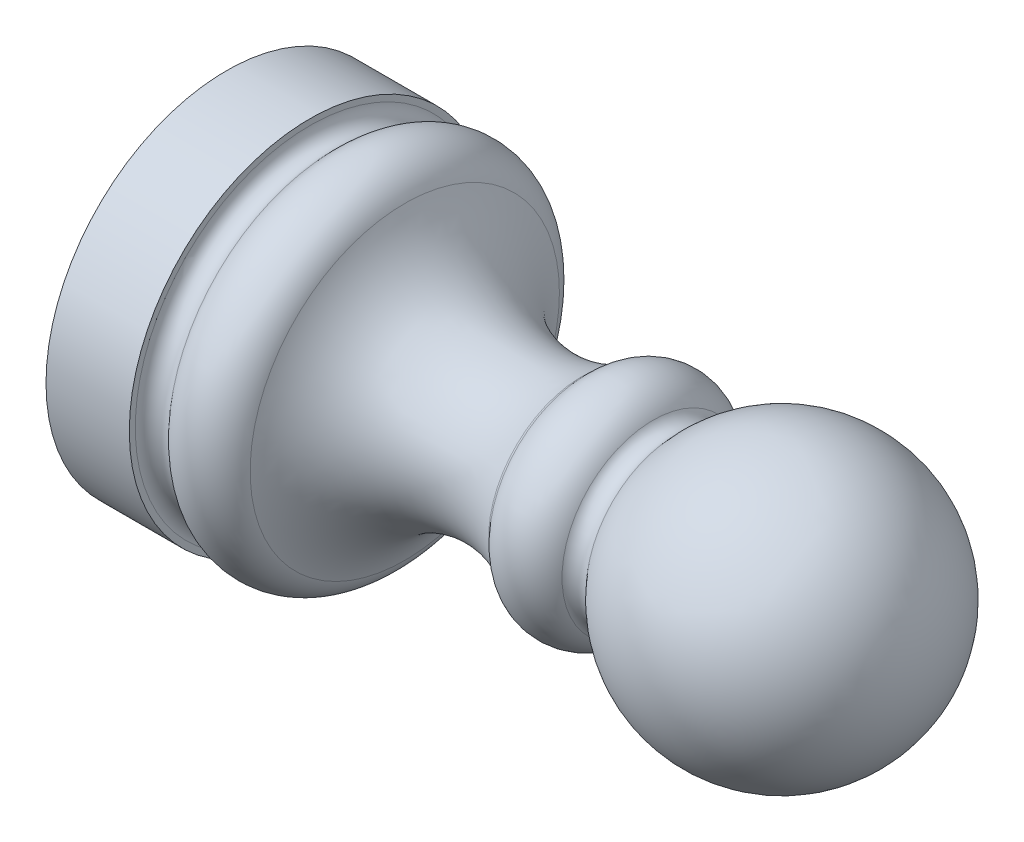
ISO-10303-21;
HEADER;
FILE_DESCRIPTION(('STEP AP214'),'2;1');
FILE_NAME('part.step','',(''),(''),'','','');
FILE_SCHEMA(('AUTOMOTIVE_DESIGN { 1 0 10303 214 1 1 1 1 }'));
ENDSEC;
DATA;
#1=APPLICATION_CONTEXT('core data for automotive mechanical design processes');
#2=APPLICATION_PROTOCOL_DEFINITION('international standard','automotive_design',2000,#1);
#3=PRODUCT_CONTEXT('',#1,'mechanical');
#4=PRODUCT('Part','Part','',(#3));
#5=PRODUCT_RELATED_PRODUCT_CATEGORY('part','',(#4));
#6=PRODUCT_DEFINITION_FORMATION('','',#4);
#7=PRODUCT_DEFINITION_CONTEXT('part definition',#1,'design');
#8=PRODUCT_DEFINITION('design','',#6,#7);
#9=PRODUCT_DEFINITION_SHAPE('','',#8);
#10=(LENGTH_UNIT() NAMED_UNIT(*) SI_UNIT(.MILLI.,.METRE.));
#11=(NAMED_UNIT(*) PLANE_ANGLE_UNIT() SI_UNIT($,.RADIAN.));
#12=(NAMED_UNIT(*) SI_UNIT($,.STERADIAN.) SOLID_ANGLE_UNIT());
#13=UNCERTAINTY_MEASURE_WITH_UNIT(LENGTH_MEASURE(1.E-05),#10,'distance_accuracy_value','');
#14=(GEOMETRIC_REPRESENTATION_CONTEXT(3) GLOBAL_UNCERTAINTY_ASSIGNED_CONTEXT((#13)) GLOBAL_UNIT_ASSIGNED_CONTEXT((#10,
#11,#12)) REPRESENTATION_CONTEXT('',''));
#15=CARTESIAN_POINT('',(0.,0.,0.));
#16=DIRECTION('',(0.,0.,1.));
#17=DIRECTION('',(1.,0.,0.));
#18=AXIS2_PLACEMENT_3D('',#15,#16,#17);
#19=CARTESIAN_POINT('',(0.,0.,0.));
#20=DIRECTION('',(1.,0.,0.));
#21=DIRECTION('',(0.,0.,-1.));
#22=AXIS2_PLACEMENT_3D('',#19,#20,#21);
#23=PLANE('',#22);
#24=CARTESIAN_POINT('',(0.,0.,0.));
#25=DIRECTION('',(1.,0.,0.));
#26=DIRECTION('',(0.,0.,-1.));
#27=AXIS2_PLACEMENT_3D('',#24,#25,#26);
#28=CIRCLE('',#27,6.5);
#29=CARTESIAN_POINT('',(0.,0.,-6.5));
#30=VERTEX_POINT('',#29);
#31=EDGE_CURVE('E10',#30,#30,#28,.T.);
#32=ORIENTED_EDGE('',*,*,#31,.F.);
#33=EDGE_LOOP('',(#32));
#34=FACE_BOUND('',#33,.T.);
#35=ADVANCED_FACE('F38',(#34),#23,.F.);
#36=CARTESIAN_POINT('',(0.,0.,0.));
#37=DIRECTION('',(1.,0.,0.));
#38=DIRECTION('',(0.,0.,-1.));
#39=AXIS2_PLACEMENT_3D('',#36,#37,#38);
#40=CYLINDRICAL_SURFACE('',#39,6.5);
#41=CARTESIAN_POINT('',(3.,0.,0.));
#42=DIRECTION('',(1.,0.,0.));
#43=DIRECTION('',(0.,0.,-1.));
#44=AXIS2_PLACEMENT_3D('',#41,#42,#43);
#45=CIRCLE('',#44,6.5);
#46=CARTESIAN_POINT('',(3.,0.,-6.5));
#47=VERTEX_POINT('',#46);
#48=EDGE_CURVE('E45',#47,#47,#45,.T.);
#49=ORIENTED_EDGE('',*,*,#48,.F.);
#50=EDGE_LOOP('',(#49));
#51=FACE_BOUND('',#50,.T.);
#52=ORIENTED_EDGE('',*,*,#31,.T.);
#53=EDGE_LOOP('',(#52));
#54=FACE_BOUND('',#53,.T.);
#55=ADVANCED_FACE('F125',(#51,#54),#40,.T.);
#56=CARTESIAN_POINT('',(3.,-6.5,0.));
#57=DIRECTION('',(-1.,0.,0.));
#58=DIRECTION('',(0.,0.,1.));
#59=AXIS2_PLACEMENT_3D('',#56,#57,#58);
#60=PLANE('',#59);
#61=CARTESIAN_POINT('',(3.,0.,0.));
#62=DIRECTION('',(1.,0.,0.));
#63=DIRECTION('',(0.,0.,-1.));
#64=AXIS2_PLACEMENT_3D('',#61,#62,#63);
#65=CIRCLE('',#64,6.28557521937307);
#66=CARTESIAN_POINT('',(3.,0.,-6.28557521937307));
#67=VERTEX_POINT('',#66);
#68=EDGE_CURVE('E51',#67,#67,#65,.T.);
#69=ORIENTED_EDGE('',*,*,#68,.F.);
#70=EDGE_LOOP('',(#69));
#71=FACE_BOUND('',#70,.T.);
#72=ORIENTED_EDGE('',*,*,#48,.T.);
#73=EDGE_LOOP('',(#72));
#74=FACE_BOUND('',#73,.T.);
#75=ADVANCED_FACE('F120',(#71,#74),#60,.F.);
#76=CARTESIAN_POINT('',(3.5,0.,0.));
#77=DIRECTION('',(1.,0.,0.));
#78=DIRECTION('',(0.,0.,-1.));
#79=AXIS2_PLACEMENT_3D('',#76,#77,#78);
#80=TOROIDAL_SURFACE('',#79,6.28557521937307,0.5);
#81=CARTESIAN_POINT('',(3.88302222155949,0.,0.));
#82=DIRECTION('',(1.,0.,0.));
#83=DIRECTION('',(0.,0.,-1.));
#84=AXIS2_PLACEMENT_3D('',#81,#82,#83);
#85=CIRCLE('',#84,5.9641814145298);
#86=CARTESIAN_POINT('',(3.88302222155949,0.,-5.9641814145298));
#87=VERTEX_POINT('',#86);
#88=EDGE_CURVE('E57',#87,#87,#85,.T.);
#89=ORIENTED_EDGE('',*,*,#88,.F.);
#90=EDGE_LOOP('',(#89));
#91=FACE_BOUND('',#90,.T.);
#92=ORIENTED_EDGE('',*,*,#68,.T.);
#93=EDGE_LOOP('',(#92));
#94=FACE_BOUND('',#93,.T.);
#95=ADVANCED_FACE('F114',(#91,#94),#80,.F.);
#96=CARTESIAN_POINT('',(5.03208888623796,0.,0.));
#97=DIRECTION('',(1.,0.,0.));
#98=DIRECTION('',(0.,0.,-1.));
#99=AXIS2_PLACEMENT_3D('',#96,#97,#98);
#100=TOROIDAL_SURFACE('',#99,5.,1.5);
#101=CARTESIAN_POINT('',(6.4202663840499,0.,0.));
#102=DIRECTION('',(1.,0.,0.));
#103=DIRECTION('',(0.,0.,-1.));
#104=AXIS2_PLACEMENT_3D('',#101,#102,#103);
#105=CIRCLE('',#104,5.56829854352145);
#106=CARTESIAN_POINT('',(6.4202663840499,0.,-5.56829854352145));
#107=VERTEX_POINT('',#106);
#108=EDGE_CURVE('E63',#107,#107,#105,.T.);
#109=ORIENTED_EDGE('',*,*,#108,.F.);
#110=EDGE_LOOP('',(#109));
#111=FACE_BOUND('',#110,.T.);
#112=ORIENTED_EDGE('',*,*,#88,.T.);
#113=EDGE_LOOP('',(#112));
#114=FACE_BOUND('',#113,.T.);
#115=ADVANCED_FACE('F108',(#111,#114),#100,.T.);
#116=CARTESIAN_POINT('',(10.5847988774857,0.,0.));
#117=DIRECTION('',(1.,0.,0.));
#118=DIRECTION('',(0.,0.,-1.));
#119=AXIS2_PLACEMENT_3D('',#116,#117,#118);
#120=TOROIDAL_SURFACE('',#119,7.2731941740858,4.5);
#121=CARTESIAN_POINT('',(12.7883387716284,0.,0.));
#122=DIRECTION('',(1.,0.,0.));
#123=DIRECTION('',(0.,0.,-1.));
#124=AXIS2_PLACEMENT_3D('',#121,#122,#123);
#125=CIRCLE('',#124,3.34962285003398);
#126=CARTESIAN_POINT('',(12.7883387716284,0.,-3.34962285003398));
#127=VERTEX_POINT('',#126);
#128=EDGE_CURVE('E67',#127,#127,#125,.T.);
#129=ORIENTED_EDGE('',*,*,#128,.F.);
#130=EDGE_LOOP('',(#129));
#131=FACE_BOUND('',#130,.T.);
#132=ORIENTED_EDGE('',*,*,#108,.T.);
#133=EDGE_LOOP('',(#132));
#134=FACE_BOUND('',#133,.T.);
#135=ADVANCED_FACE('F102',(#131,#134),#120,.F.);
#136=CARTESIAN_POINT('',(12.5435010056125,0.,0.));
#137=DIRECTION('',(1.,0.,0.));
#138=DIRECTION('',(0.,0.,-1.));
#139=AXIS2_PLACEMENT_3D('',#136,#137,#138);
#140=TOROIDAL_SURFACE('',#139,3.78557521937307,0.499999999999998);
#141=CARTESIAN_POINT('',(12.926523227172,0.,0.));
#142=DIRECTION('',(1.,0.,0.));
#143=DIRECTION('',(0.,0.,-1.));
#144=AXIS2_PLACEMENT_3D('',#141,#142,#143);
#145=CIRCLE('',#144,3.4641814145298);
#146=CARTESIAN_POINT('',(12.926523227172,0.,-3.4641814145298));
#147=VERTEX_POINT('',#146);
#148=EDGE_CURVE('E71',#147,#147,#145,.T.);
#149=ORIENTED_EDGE('',*,*,#148,.F.);
#150=EDGE_LOOP('',(#149));
#151=FACE_BOUND('',#150,.T.);
#152=ORIENTED_EDGE('',*,*,#128,.T.);
#153=EDGE_LOOP('',(#152));
#154=FACE_BOUND('',#153,.T.);
#155=ADVANCED_FACE('F96',(#151,#154),#140,.F.);
#156=CARTESIAN_POINT('',(14.0755898918505,0.,0.));
#157=DIRECTION('',(1.,0.,0.));
#158=DIRECTION('',(0.,0.,-1.));
#159=AXIS2_PLACEMENT_3D('',#156,#157,#158);
#160=TOROIDAL_SURFACE('',#159,2.5,1.5);
#161=CARTESIAN_POINT('',(15.3589641450968,0.,0.));
#162=DIRECTION('',(1.,0.,0.));
#163=DIRECTION('',(0.,0.,-1.));
#164=AXIS2_PLACEMENT_3D('',#161,#162,#163);
#165=CIRCLE('',#164,3.27649888995696);
#166=CARTESIAN_POINT('',(15.3589641450968,0.,-3.27649888995696));
#167=VERTEX_POINT('',#166);
#168=EDGE_CURVE('E75',#167,#167,#165,.T.);
#169=ORIENTED_EDGE('',*,*,#168,.F.);
#170=EDGE_LOOP('',(#169));
#171=FACE_BOUND('',#170,.T.);
#172=ORIENTED_EDGE('',*,*,#148,.T.);
#173=EDGE_LOOP('',(#172));
#174=FACE_BOUND('',#173,.T.);
#175=ADVANCED_FACE('F90',(#171,#174),#160,.T.);
#176=CARTESIAN_POINT('',(15.7867555628456,0.,0.));
#177=DIRECTION('',(1.,0.,0.));
#178=DIRECTION('',(0.,0.,-1.));
#179=AXIS2_PLACEMENT_3D('',#176,#177,#178);
#180=TOROIDAL_SURFACE('',#179,3.53533185327594,0.5);
#181=CARTESIAN_POINT('',(16.1697777844051,0.,0.));
#182=DIRECTION('',(1.,0.,0.));
#183=DIRECTION('',(0.,0.,-1.));
#184=AXIS2_PLACEMENT_3D('',#181,#182,#183);
#185=CIRCLE('',#184,3.21393804843267);
#186=CARTESIAN_POINT('',(16.1697777844051,0.,-3.21393804843267));
#187=VERTEX_POINT('',#186);
#188=EDGE_CURVE('E79',#187,#187,#185,.T.);
#189=ORIENTED_EDGE('',*,*,#188,.F.);
#190=EDGE_LOOP('',(#189));
#191=FACE_BOUND('',#190,.T.);
#192=ORIENTED_EDGE('',*,*,#168,.T.);
#193=EDGE_LOOP('',(#192));
#194=FACE_BOUND('',#193,.T.);
#195=ADVANCED_FACE('F87',(#191,#194),#180,.F.);
#196=CARTESIAN_POINT('',(20.,0.,0.));
#197=DIRECTION('',(1.,0.,0.));
#198=DIRECTION('',(0.,-1.,0.));
#199=AXIS2_PLACEMENT_3D('',#196,#197,#198);
#200=SPHERICAL_SURFACE('',#199,5.);
#201=ORIENTED_EDGE('',*,*,#188,.T.);
#202=EDGE_LOOP('',(#201));
#203=FACE_BOUND('',#202,.T.);
#204=ADVANCED_FACE('F85',(#203),#200,.T.);
#205=CLOSED_SHELL('',(#35,#55,#75,#95,#115,#135,#155,#175,#195,#204));
#206=MANIFOLD_SOLID_BREP('B2',#205);
#207=ADVANCED_BREP_SHAPE_REPRESENTATION('',(#18,#206),#14);
#208=SHAPE_DEFINITION_REPRESENTATION(#9,#207);
ENDSEC;
END-ISO-10303-21;
